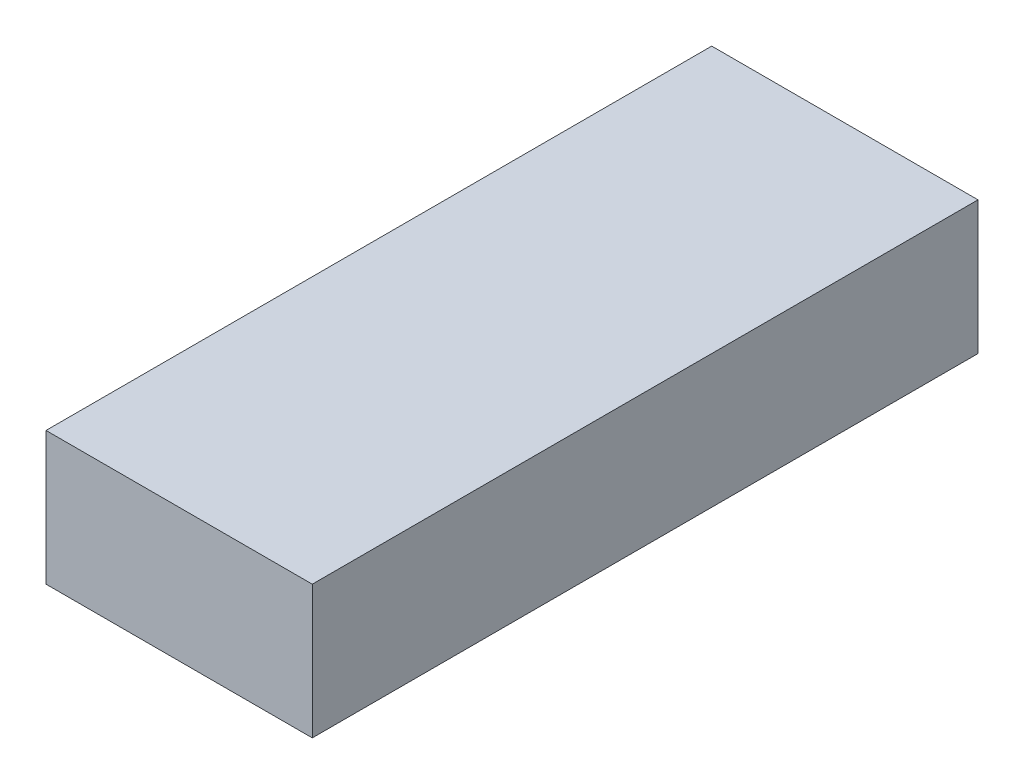
ISO-10303-21;
HEADER;
FILE_DESCRIPTION(('STEP AP214'),'2;1');
FILE_NAME('part.step','',(''),(''),'','','');
FILE_SCHEMA(('AUTOMOTIVE_DESIGN { 1 0 10303 214 1 1 1 1 }'));
ENDSEC;
DATA;
#1=APPLICATION_CONTEXT('core data for automotive mechanical design processes');
#2=APPLICATION_PROTOCOL_DEFINITION('international standard','automotive_design',2000,#1);
#3=PRODUCT_CONTEXT('',#1,'mechanical');
#4=PRODUCT('Part','Part','',(#3));
#5=PRODUCT_RELATED_PRODUCT_CATEGORY('part','',(#4));
#6=PRODUCT_DEFINITION_FORMATION('','',#4);
#7=PRODUCT_DEFINITION_CONTEXT('part definition',#1,'design');
#8=PRODUCT_DEFINITION('design','',#6,#7);
#9=PRODUCT_DEFINITION_SHAPE('','',#8);
#10=(LENGTH_UNIT() NAMED_UNIT(*) SI_UNIT(.MILLI.,.METRE.));
#11=(NAMED_UNIT(*) PLANE_ANGLE_UNIT() SI_UNIT($,.RADIAN.));
#12=(NAMED_UNIT(*) SI_UNIT($,.STERADIAN.) SOLID_ANGLE_UNIT());
#13=UNCERTAINTY_MEASURE_WITH_UNIT(LENGTH_MEASURE(1.E-05),#10,'distance_accuracy_value','');
#14=(GEOMETRIC_REPRESENTATION_CONTEXT(3) GLOBAL_UNCERTAINTY_ASSIGNED_CONTEXT((#13)) GLOBAL_UNIT_ASSIGNED_CONTEXT((#10,
#11,#12)) REPRESENTATION_CONTEXT('',''));
#15=CARTESIAN_POINT('',(0.,0.,0.));
#16=DIRECTION('',(0.,0.,1.));
#17=DIRECTION('',(1.,0.,0.));
#18=AXIS2_PLACEMENT_3D('',#15,#16,#17);
#19=CARTESIAN_POINT('',(-65.,0.,70.2));
#20=DIRECTION('',(-1.,0.,0.));
#21=DIRECTION('',(0.,0.,1.));
#22=AXIS2_PLACEMENT_3D('',#19,#20,#21);
#23=PLANE('',#22);
#24=DIRECTION('',(0.,1.,0.));
#25=VECTOR('',#24,1.);
#26=CARTESIAN_POINT('',(-65.,0.,20.2));
#27=LINE('',#26,#25);
#28=CARTESIAN_POINT('',(-65.,-71.,20.2));
#29=VERTEX_POINT('',#28);
#30=CARTESIAN_POINT('',(-65.,-61.,20.2));
#31=VERTEX_POINT('',#30);
#32=EDGE_CURVE('E98',#29,#31,#27,.T.);
#33=ORIENTED_EDGE('',*,*,#32,.F.);
#34=DIRECTION('',(0.,0.,-1.));
#35=VECTOR('',#34,1.);
#36=CARTESIAN_POINT('',(-65.,-71.,70.2));
#37=LINE('',#36,#35);
#38=CARTESIAN_POINT('',(-65.,-71.,70.2));
#39=VERTEX_POINT('',#38);
#40=EDGE_CURVE('E11',#39,#29,#37,.T.);
#41=ORIENTED_EDGE('',*,*,#40,.F.);
#42=DIRECTION('',(0.,1.,0.));
#43=VECTOR('',#42,1.);
#44=CARTESIAN_POINT('',(-65.,0.,70.2));
#45=LINE('',#44,#43);
#46=CARTESIAN_POINT('',(-65.,-61.,70.2));
#47=VERTEX_POINT('',#46);
#48=EDGE_CURVE('E92',#39,#47,#45,.T.);
#49=ORIENTED_EDGE('',*,*,#48,.T.);
#50=DIRECTION('',(0.,0.,-1.));
#51=VECTOR('',#50,1.);
#52=CARTESIAN_POINT('',(-65.,-61.,70.2));
#53=LINE('',#52,#51);
#54=EDGE_CURVE('E73',#47,#31,#53,.T.);
#55=ORIENTED_EDGE('',*,*,#54,.T.);
#56=EDGE_LOOP('',(#33,#41,#49,#55));
#57=FACE_BOUND('',#56,.T.);
#58=ADVANCED_FACE('F35',(#57),#23,.T.);
#59=CARTESIAN_POINT('',(0.,-71.,70.2));
#60=DIRECTION('',(0.,-1.,0.));
#61=DIRECTION('',(0.,0.,-1.));
#62=AXIS2_PLACEMENT_3D('',#59,#60,#61);
#63=PLANE('',#62);
#64=DIRECTION('',(-1.,0.,0.));
#65=VECTOR('',#64,1.);
#66=CARTESIAN_POINT('',(0.,-71.,20.2));
#67=LINE('',#66,#65);
#68=CARTESIAN_POINT('',(-45.,-71.,20.2));
#69=VERTEX_POINT('',#68);
#70=EDGE_CURVE('E86',#69,#29,#67,.T.);
#71=ORIENTED_EDGE('',*,*,#70,.F.);
#72=DIRECTION('',(0.,0.,-1.));
#73=VECTOR('',#72,1.);
#74=CARTESIAN_POINT('',(-45.,-71.,70.2));
#75=LINE('',#74,#73);
#76=CARTESIAN_POINT('',(-45.,-71.,70.2));
#77=VERTEX_POINT('',#76);
#78=EDGE_CURVE('E43',#77,#69,#75,.T.);
#79=ORIENTED_EDGE('',*,*,#78,.F.);
#80=DIRECTION('',(-1.,0.,0.));
#81=VECTOR('',#80,1.);
#82=CARTESIAN_POINT('',(0.,-71.,70.2));
#83=LINE('',#82,#81);
#84=EDGE_CURVE('E84',#77,#39,#83,.T.);
#85=ORIENTED_EDGE('',*,*,#84,.T.);
#86=ORIENTED_EDGE('',*,*,#40,.T.);
#87=EDGE_LOOP('',(#71,#79,#85,#86));
#88=FACE_BOUND('',#87,.T.);
#89=ADVANCED_FACE('F82',(#88),#63,.T.);
#90=CARTESIAN_POINT('',(0.,-61.,70.2));
#91=DIRECTION('',(0.,-1.,0.));
#92=DIRECTION('',(1.,0.,0.));
#93=AXIS2_PLACEMENT_3D('',#90,#91,#92);
#94=PLANE('',#93);
#95=DIRECTION('',(-1.,0.,0.));
#96=VECTOR('',#95,1.);
#97=CARTESIAN_POINT('',(0.,-61.,20.2));
#98=LINE('',#97,#96);
#99=CARTESIAN_POINT('',(-45.,-61.,20.2));
#100=VERTEX_POINT('',#99);
#101=EDGE_CURVE('E94',#100,#31,#98,.T.);
#102=ORIENTED_EDGE('',*,*,#101,.T.);
#103=ORIENTED_EDGE('',*,*,#54,.F.);
#104=DIRECTION('',(-1.,0.,0.));
#105=VECTOR('',#104,1.);
#106=CARTESIAN_POINT('',(0.,-61.,70.2));
#107=LINE('',#106,#105);
#108=CARTESIAN_POINT('',(-45.,-61.,70.2));
#109=VERTEX_POINT('',#108);
#110=EDGE_CURVE('E51',#109,#47,#107,.T.);
#111=ORIENTED_EDGE('',*,*,#110,.F.);
#112=DIRECTION('',(0.,0.,-1.));
#113=VECTOR('',#112,1.);
#114=CARTESIAN_POINT('',(-45.,-61.,70.2));
#115=LINE('',#114,#113);
#116=EDGE_CURVE('E87',#109,#100,#115,.T.);
#117=ORIENTED_EDGE('',*,*,#116,.T.);
#118=EDGE_LOOP('',(#102,#103,#111,#117));
#119=FACE_BOUND('',#118,.T.);
#120=ADVANCED_FACE('F107',(#119),#94,.F.);
#121=CARTESIAN_POINT('',(0.,0.,70.2));
#122=DIRECTION('',(0.,0.,1.));
#123=DIRECTION('',(1.,0.,0.));
#124=AXIS2_PLACEMENT_3D('',#121,#122,#123);
#125=PLANE('',#124);
#126=ORIENTED_EDGE('',*,*,#48,.F.);
#127=ORIENTED_EDGE('',*,*,#84,.F.);
#128=DIRECTION('',(0.,1.,0.));
#129=VECTOR('',#128,1.);
#130=CARTESIAN_POINT('',(-45.,0.,70.2));
#131=LINE('',#130,#129);
#132=EDGE_CURVE('E88',#77,#109,#131,.T.);
#133=ORIENTED_EDGE('',*,*,#132,.T.);
#134=ORIENTED_EDGE('',*,*,#110,.T.);
#135=EDGE_LOOP('',(#126,#127,#133,#134));
#136=FACE_BOUND('',#135,.T.);
#137=ADVANCED_FACE('F91',(#136),#125,.T.);
#138=CARTESIAN_POINT('',(0.,0.,20.2));
#139=DIRECTION('',(0.,0.,1.));
#140=DIRECTION('',(1.,0.,0.));
#141=AXIS2_PLACEMENT_3D('',#138,#139,#140);
#142=PLANE('',#141);
#143=ORIENTED_EDGE('',*,*,#32,.T.);
#144=ORIENTED_EDGE('',*,*,#101,.F.);
#145=DIRECTION('',(0.,1.,0.));
#146=VECTOR('',#145,1.);
#147=CARTESIAN_POINT('',(-45.,0.,20.2));
#148=LINE('',#147,#146);
#149=EDGE_CURVE('E66',#69,#100,#148,.T.);
#150=ORIENTED_EDGE('',*,*,#149,.F.);
#151=ORIENTED_EDGE('',*,*,#70,.T.);
#152=EDGE_LOOP('',(#143,#144,#150,#151));
#153=FACE_BOUND('',#152,.T.);
#154=ADVANCED_FACE('F109',(#153),#142,.F.);
#155=CARTESIAN_POINT('',(-45.,0.,70.2));
#156=DIRECTION('',(-1.,0.,0.));
#157=DIRECTION('',(0.,0.,1.));
#158=AXIS2_PLACEMENT_3D('',#155,#156,#157);
#159=PLANE('',#158);
#160=ORIENTED_EDGE('',*,*,#149,.T.);
#161=ORIENTED_EDGE('',*,*,#116,.F.);
#162=ORIENTED_EDGE('',*,*,#132,.F.);
#163=ORIENTED_EDGE('',*,*,#78,.T.);
#164=EDGE_LOOP('',(#160,#161,#162,#163));
#165=FACE_BOUND('',#164,.T.);
#166=ADVANCED_FACE('F89',(#165),#159,.F.);
#167=CLOSED_SHELL('',(#58,#89,#120,#137,#154,#166));
#168=MANIFOLD_SOLID_BREP('B2',#167);
#169=ADVANCED_BREP_SHAPE_REPRESENTATION('',(#18,#168),#14);
#170=SHAPE_DEFINITION_REPRESENTATION(#9,#169);
ENDSEC;
END-ISO-10303-21;
